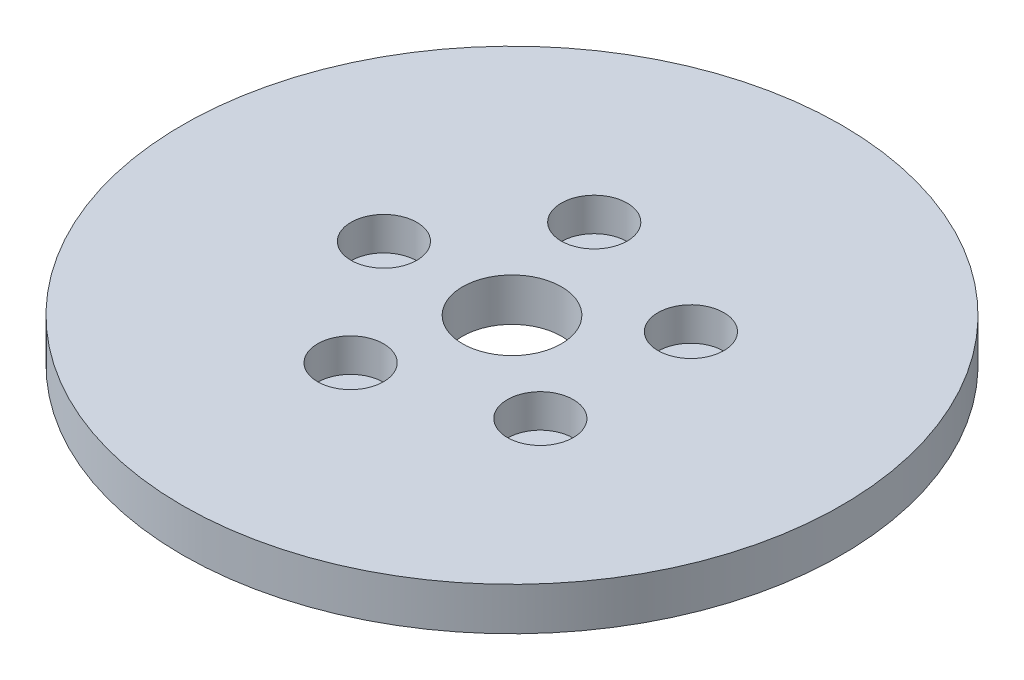
ISO-10303-21;
HEADER;
FILE_DESCRIPTION(('STEP AP214'),'2;1');
FILE_NAME('part.step','',(''),(''),'','','');
FILE_SCHEMA(('AUTOMOTIVE_DESIGN { 1 0 10303 214 1 1 1 1 }'));
ENDSEC;
DATA;
#1=APPLICATION_CONTEXT('core data for automotive mechanical design processes');
#2=APPLICATION_PROTOCOL_DEFINITION('international standard','automotive_design',2000,#1);
#3=PRODUCT_CONTEXT('',#1,'mechanical');
#4=PRODUCT('Part','Part','',(#3));
#5=PRODUCT_RELATED_PRODUCT_CATEGORY('part','',(#4));
#6=PRODUCT_DEFINITION_FORMATION('','',#4);
#7=PRODUCT_DEFINITION_CONTEXT('part definition',#1,'design');
#8=PRODUCT_DEFINITION('design','',#6,#7);
#9=PRODUCT_DEFINITION_SHAPE('','',#8);
#10=(LENGTH_UNIT() NAMED_UNIT(*) SI_UNIT(.MILLI.,.METRE.));
#11=(NAMED_UNIT(*) PLANE_ANGLE_UNIT() SI_UNIT($,.RADIAN.));
#12=(NAMED_UNIT(*) SI_UNIT($,.STERADIAN.) SOLID_ANGLE_UNIT());
#13=UNCERTAINTY_MEASURE_WITH_UNIT(LENGTH_MEASURE(1.E-05),#10,'distance_accuracy_value','');
#14=(GEOMETRIC_REPRESENTATION_CONTEXT(3) GLOBAL_UNCERTAINTY_ASSIGNED_CONTEXT((#13)) GLOBAL_UNIT_ASSIGNED_CONTEXT((#10,
#11,#12)) REPRESENTATION_CONTEXT('',''));
#15=CARTESIAN_POINT('',(0.,0.,0.));
#16=DIRECTION('',(0.,0.,1.));
#17=DIRECTION('',(1.,0.,0.));
#18=AXIS2_PLACEMENT_3D('',#15,#16,#17);
#19=CARTESIAN_POINT('',(0.,13.,0.));
#20=DIRECTION('',(0.,-1.,0.));
#21=DIRECTION('',(0.,0.,-1.));
#22=AXIS2_PLACEMENT_3D('',#19,#20,#21);
#23=CYLINDRICAL_SURFACE('',#22,100.);
#24=CARTESIAN_POINT('',(0.,13.,0.));
#25=DIRECTION('',(0.,1.,0.));
#26=DIRECTION('',(0.,0.,1.));
#27=AXIS2_PLACEMENT_3D('',#24,#25,#26);
#28=CIRCLE('',#27,100.);
#29=CARTESIAN_POINT('',(0.,13.,-100.));
#30=VERTEX_POINT('',#29);
#31=EDGE_CURVE('E10',#30,#30,#28,.T.);
#32=CARTESIAN_POINT('',(0.,0.,0.));
#33=DIRECTION('',(0.,1.,0.));
#34=DIRECTION('',(0.,0.,1.));
#35=AXIS2_PLACEMENT_3D('',#32,#33,#34);
#36=CIRCLE('',#35,100.);
#37=CARTESIAN_POINT('',(0.,0.,-100.));
#38=VERTEX_POINT('',#37);
#39=EDGE_CURVE('E37',#38,#38,#36,.T.);
#40=CARTESIAN_POINT('',(0.,13.,-100.));
#41=CARTESIAN_POINT('',(0.,12.8645833333333,-100.));
#42=CARTESIAN_POINT('',(0.,12.7291666666667,-100.));
#43=CARTESIAN_POINT('',(0.,12.4583333333333,-100.));
#44=CARTESIAN_POINT('',(0.,12.3229166666667,-100.));
#45=CARTESIAN_POINT('',(0.,12.0520833333333,-100.));
#46=CARTESIAN_POINT('',(0.,11.9166666666667,-100.));
#47=CARTESIAN_POINT('',(0.,11.6458333333333,-100.));
#48=CARTESIAN_POINT('',(0.,11.5104166666667,-100.));
#49=CARTESIAN_POINT('',(0.,11.2395833333333,-100.));
#50=CARTESIAN_POINT('',(0.,11.1041666666667,-100.));
#51=CARTESIAN_POINT('',(0.,10.8333333333333,-100.));
#52=CARTESIAN_POINT('',(0.,10.6979166666667,-100.));
#53=CARTESIAN_POINT('',(0.,10.4270833333333,-100.));
#54=CARTESIAN_POINT('',(0.,10.2916666666667,-100.));
#55=CARTESIAN_POINT('',(0.,10.0208333333333,-100.));
#56=CARTESIAN_POINT('',(0.,9.88541666666667,-100.));
#57=CARTESIAN_POINT('',(0.,9.61458333333333,-100.));
#58=CARTESIAN_POINT('',(0.,9.47916666666667,-100.));
#59=CARTESIAN_POINT('',(0.,9.20833333333333,-100.));
#60=CARTESIAN_POINT('',(0.,9.07291666666666,-100.));
#61=CARTESIAN_POINT('',(0.,8.80208333333333,-100.));
#62=CARTESIAN_POINT('',(0.,8.66666666666667,-100.));
#63=CARTESIAN_POINT('',(0.,8.39583333333333,-100.));
#64=CARTESIAN_POINT('',(0.,8.26041666666667,-100.));
#65=CARTESIAN_POINT('',(0.,7.98958333333333,-100.));
#66=CARTESIAN_POINT('',(0.,7.85416666666667,-100.));
#67=CARTESIAN_POINT('',(0.,7.58333333333333,-100.));
#68=CARTESIAN_POINT('',(0.,7.44791666666667,-100.));
#69=CARTESIAN_POINT('',(0.,7.17708333333333,-100.));
#70=CARTESIAN_POINT('',(0.,7.04166666666667,-100.));
#71=CARTESIAN_POINT('',(0.,6.77083333333333,-100.));
#72=CARTESIAN_POINT('',(0.,6.63541666666667,-100.));
#73=CARTESIAN_POINT('',(0.,6.36458333333333,-100.));
#74=CARTESIAN_POINT('',(0.,6.22916666666667,-100.));
#75=CARTESIAN_POINT('',(0.,5.95833333333333,-100.));
#76=CARTESIAN_POINT('',(0.,5.82291666666667,-100.));
#77=CARTESIAN_POINT('',(0.,5.55208333333333,-100.));
#78=CARTESIAN_POINT('',(0.,5.41666666666667,-100.));
#79=CARTESIAN_POINT('',(0.,5.14583333333333,-100.));
#80=CARTESIAN_POINT('',(0.,5.01041666666667,-100.));
#81=CARTESIAN_POINT('',(0.,4.73958333333333,-100.));
#82=CARTESIAN_POINT('',(0.,4.60416666666667,-100.));
#83=CARTESIAN_POINT('',(0.,4.33333333333333,-100.));
#84=CARTESIAN_POINT('',(0.,4.19791666666667,-100.));
#85=CARTESIAN_POINT('',(0.,3.92708333333333,-100.));
#86=CARTESIAN_POINT('',(0.,3.79166666666667,-100.));
#87=CARTESIAN_POINT('',(0.,3.52083333333333,-100.));
#88=CARTESIAN_POINT('',(0.,3.38541666666667,-100.));
#89=CARTESIAN_POINT('',(0.,3.11458333333333,-100.));
#90=CARTESIAN_POINT('',(0.,2.97916666666667,-100.));
#91=CARTESIAN_POINT('',(0.,2.70833333333333,-100.));
#92=CARTESIAN_POINT('',(0.,2.57291666666667,-100.));
#93=CARTESIAN_POINT('',(0.,2.30208333333333,-100.));
#94=CARTESIAN_POINT('',(0.,2.16666666666667,-100.));
#95=CARTESIAN_POINT('',(0.,1.89583333333333,-100.));
#96=CARTESIAN_POINT('',(0.,1.76041666666667,-100.));
#97=CARTESIAN_POINT('',(0.,1.48958333333333,-100.));
#98=CARTESIAN_POINT('',(0.,1.35416666666667,-100.));
#99=CARTESIAN_POINT('',(0.,1.08333333333333,-100.));
#100=CARTESIAN_POINT('',(0.,0.947916666666667,-100.));
#101=CARTESIAN_POINT('',(0.,0.677083333333334,-100.));
#102=CARTESIAN_POINT('',(0.,0.541666666666667,-100.));
#103=CARTESIAN_POINT('',(0.,0.270833333333334,-100.));
#104=CARTESIAN_POINT('',(0.,0.135416666666667,-100.));
#105=CARTESIAN_POINT('',(0.,0.,-100.));
#106=B_SPLINE_CURVE_WITH_KNOTS('',3,(#40,#41,#42,#43,#44,#45,#46,#47,#48,#49,#50,#51,#52,#53,
#54,#55,#56,#57,#58,#59,#60,#61,#62,#63,#64,#65,#66,#67,#68,#69,#70,#71,#72,#73,#74,#75,#76,#77,
#78,#79,#80,#81,#82,#83,#84,#85,#86,#87,#88,#89,#90,#91,#92,#93,#94,#95,#96,#97,#98,#99,#100,
#101,#102,#103,#104,#105),.UNSPECIFIED.,.F.,.F.,(4,2,2,2,2,2,2,2,2,2,2,2,2,2,2,2,2,2,2,2,2,2,2,
2,2,2,2,2,2,2,2,2,4),(0.,0.40625,0.812500000000001,1.21875,1.625,2.03125,2.4375,2.84375,3.25,
3.65625,4.0625,4.46875,4.875,5.28125,5.6875,6.09375,6.5,6.90625,7.3125,7.71875,8.125,8.53125,
8.9375,9.34375,9.75,10.15625,10.5625,10.96875,11.375,11.78125,12.1875,12.59375,13.),.UNSPECIFIED.);
#107=EDGE_CURVE('BSEAM40',#30,#38,#106,.T.);
#108=ORIENTED_EDGE('',*,*,#31,.F.);
#109=ORIENTED_EDGE('',*,*,#39,.T.);
#110=ORIENTED_EDGE('',*,*,#107,.T.);
#111=ORIENTED_EDGE('',*,*,#107,.F.);
#112=EDGE_LOOP('',(#108,#110,#109,#111));
#113=FACE_BOUND('',#112,.T.);
#114=ADVANCED_FACE('F40',(#113),#23,.T.);
#115=CARTESIAN_POINT('',(0.,13.,0.));
#116=DIRECTION('',(0.,1.,0.));
#117=DIRECTION('',(0.,0.,1.));
#118=AXIS2_PLACEMENT_3D('',#115,#116,#117);
#119=PLANE('',#118);
#120=CARTESIAN_POINT('',(-12.0110621570786,13.,-36.9662482648281));
#121=DIRECTION('',(0.,1.,0.));
#122=DIRECTION('',(-0.95105651629515,0.,0.309016994374958));
#123=AXIS2_PLACEMENT_3D('',#120,#121,#122);
#124=CIRCLE('',#123,10.);
#125=CARTESIAN_POINT('',(-21.5216273200301,13.,-33.8760783210785));
#126=VERTEX_POINT('',#125);
#127=EDGE_CURVE('E70',#126,#126,#124,.T.);
#128=ORIENTED_EDGE('',*,*,#127,.F.);
#129=EDGE_LOOP('',(#128));
#130=FACE_BOUND('',#129,.T.);
#131=CARTESIAN_POINT('',(31.4453689682181,13.,-22.846397864231));
#132=DIRECTION('',(0.,1.,0.));
#133=DIRECTION('',(-0.58778525229248,0.,-0.809016994374942));
#134=AXIS2_PLACEMENT_3D('',#131,#132,#133);
#135=CIRCLE('',#134,10.);
#136=CARTESIAN_POINT('',(25.5675164452933,13.,-30.9365678079804));
#137=VERTEX_POINT('',#136);
#138=EDGE_CURVE('E71',#137,#137,#135,.T.);
#139=ORIENTED_EDGE('',*,*,#138,.F.);
#140=EDGE_LOOP('',(#139));
#141=FACE_BOUND('',#140,.T.);
#142=CARTESIAN_POINT('',(31.4453689682185,13.,22.8463978642305));
#143=DIRECTION('',(0.,1.,0.));
#144=DIRECTION('',(0.587785252292469,0.,-0.809016994374951));
#145=AXIS2_PLACEMENT_3D('',#142,#143,#144);
#146=CIRCLE('',#145,10.);
#147=CARTESIAN_POINT('',(37.3232214911432,13.,14.756227920481));
#148=VERTEX_POINT('',#147);
#149=EDGE_CURVE('E78',#148,#148,#146,.T.);
#150=ORIENTED_EDGE('',*,*,#149,.F.);
#151=EDGE_LOOP('',(#150));
#152=FACE_BOUND('',#151,.T.);
#153=CARTESIAN_POINT('',(-12.0110621570781,13.,36.9662482648283));
#154=DIRECTION('',(0.,1.,0.));
#155=DIRECTION('',(0.951056516295155,0.,0.309016994374945));
#156=AXIS2_PLACEMENT_3D('',#153,#154,#155);
#157=CIRCLE('',#156,10.);
#158=CARTESIAN_POINT('',(-2.50049699412654,13.,40.0564182085777));
#159=VERTEX_POINT('',#158);
#160=EDGE_CURVE('E61',#159,#159,#157,.T.);
#161=ORIENTED_EDGE('',*,*,#160,.F.);
#162=EDGE_LOOP('',(#161));
#163=FACE_BOUND('',#162,.T.);
#164=CARTESIAN_POINT('',(-38.8686136222803,13.,0.));
#165=DIRECTION('',(0.,1.,0.));
#166=DIRECTION('',(0.,0.,1.));
#167=AXIS2_PLACEMENT_3D('',#164,#165,#166);
#168=CIRCLE('',#167,10.);
#169=CARTESIAN_POINT('',(-38.8686136222803,13.,10.));
#170=VERTEX_POINT('',#169);
#171=EDGE_CURVE('E54',#170,#170,#168,.T.);
#172=ORIENTED_EDGE('',*,*,#171,.F.);
#173=EDGE_LOOP('',(#172));
#174=FACE_BOUND('',#173,.T.);
#175=CARTESIAN_POINT('',(0.,13.,0.));
#176=DIRECTION('',(0.,1.,0.));
#177=DIRECTION('',(0.,0.,1.));
#178=AXIS2_PLACEMENT_3D('',#175,#176,#177);
#179=CIRCLE('',#178,15.);
#180=CARTESIAN_POINT('',(0.,13.,-15.));
#181=VERTEX_POINT('',#180);
#182=EDGE_CURVE('E50',#181,#181,#179,.T.);
#183=ORIENTED_EDGE('',*,*,#182,.F.);
#184=EDGE_LOOP('',(#183));
#185=FACE_BOUND('',#184,.T.);
#186=ORIENTED_EDGE('',*,*,#31,.T.);
#187=EDGE_LOOP('',(#186));
#188=FACE_BOUND('',#187,.T.);
#189=ADVANCED_FACE('F94',(#130,#141,#152,#163,#174,#185,#188),#119,.T.);
#190=CARTESIAN_POINT('',(0.,0.,0.));
#191=DIRECTION('',(0.,1.,0.));
#192=DIRECTION('',(0.,0.,1.));
#193=AXIS2_PLACEMENT_3D('',#190,#191,#192);
#194=PLANE('',#193);
#195=CARTESIAN_POINT('',(0.,0.,0.));
#196=DIRECTION('',(0.,1.,0.));
#197=DIRECTION('',(0.,0.,1.));
#198=AXIS2_PLACEMENT_3D('',#195,#196,#197);
#199=CIRCLE('',#198,15.);
#200=CARTESIAN_POINT('',(0.,0.,-15.));
#201=VERTEX_POINT('',#200);
#202=EDGE_CURVE('E47',#201,#201,#199,.T.);
#203=ORIENTED_EDGE('',*,*,#202,.T.);
#204=EDGE_LOOP('',(#203));
#205=FACE_BOUND('',#204,.T.);
#206=ORIENTED_EDGE('',*,*,#39,.F.);
#207=EDGE_LOOP('',(#206));
#208=FACE_BOUND('',#207,.T.);
#209=ADVANCED_FACE('F100',(#205,#208),#194,.F.);
#210=CARTESIAN_POINT('',(0.,13.,0.));
#211=DIRECTION('',(0.,-1.,0.));
#212=DIRECTION('',(0.,0.,-1.));
#213=AXIS2_PLACEMENT_3D('',#210,#211,#212);
#214=CYLINDRICAL_SURFACE('',#213,15.);
#215=CARTESIAN_POINT('',(0.,13.,-15.));
#216=CARTESIAN_POINT('',(0.,12.8645833333333,-15.));
#217=CARTESIAN_POINT('',(0.,12.7291666666667,-15.));
#218=CARTESIAN_POINT('',(0.,12.4583333333333,-15.));
#219=CARTESIAN_POINT('',(0.,12.3229166666667,-15.));
#220=CARTESIAN_POINT('',(0.,12.0520833333333,-15.));
#221=CARTESIAN_POINT('',(0.,11.9166666666667,-15.));
#222=CARTESIAN_POINT('',(0.,11.6458333333333,-15.));
#223=CARTESIAN_POINT('',(0.,11.5104166666667,-15.));
#224=CARTESIAN_POINT('',(0.,11.2395833333333,-15.));
#225=CARTESIAN_POINT('',(0.,11.1041666666667,-15.));
#226=CARTESIAN_POINT('',(0.,10.8333333333333,-15.));
#227=CARTESIAN_POINT('',(0.,10.6979166666667,-15.));
#228=CARTESIAN_POINT('',(0.,10.4270833333333,-15.));
#229=CARTESIAN_POINT('',(0.,10.2916666666667,-15.));
#230=CARTESIAN_POINT('',(0.,10.0208333333333,-15.));
#231=CARTESIAN_POINT('',(0.,9.88541666666667,-15.));
#232=CARTESIAN_POINT('',(0.,9.61458333333333,-15.));
#233=CARTESIAN_POINT('',(0.,9.47916666666667,-15.));
#234=CARTESIAN_POINT('',(0.,9.20833333333333,-15.));
#235=CARTESIAN_POINT('',(0.,9.07291666666666,-15.));
#236=CARTESIAN_POINT('',(0.,8.80208333333333,-15.));
#237=CARTESIAN_POINT('',(0.,8.66666666666667,-15.));
#238=CARTESIAN_POINT('',(0.,8.39583333333333,-15.));
#239=CARTESIAN_POINT('',(0.,8.26041666666667,-15.));
#240=CARTESIAN_POINT('',(0.,7.98958333333333,-15.));
#241=CARTESIAN_POINT('',(0.,7.85416666666667,-15.));
#242=CARTESIAN_POINT('',(0.,7.58333333333333,-15.));
#243=CARTESIAN_POINT('',(0.,7.44791666666667,-15.));
#244=CARTESIAN_POINT('',(0.,7.17708333333333,-15.));
#245=CARTESIAN_POINT('',(0.,7.04166666666667,-15.));
#246=CARTESIAN_POINT('',(0.,6.77083333333333,-15.));
#247=CARTESIAN_POINT('',(0.,6.63541666666667,-15.));
#248=CARTESIAN_POINT('',(0.,6.36458333333333,-15.));
#249=CARTESIAN_POINT('',(0.,6.22916666666667,-15.));
#250=CARTESIAN_POINT('',(0.,5.95833333333333,-15.));
#251=CARTESIAN_POINT('',(0.,5.82291666666667,-15.));
#252=CARTESIAN_POINT('',(0.,5.55208333333333,-15.));
#253=CARTESIAN_POINT('',(0.,5.41666666666667,-15.));
#254=CARTESIAN_POINT('',(0.,5.14583333333333,-15.));
#255=CARTESIAN_POINT('',(0.,5.01041666666667,-15.));
#256=CARTESIAN_POINT('',(0.,4.73958333333333,-15.));
#257=CARTESIAN_POINT('',(0.,4.60416666666667,-15.));
#258=CARTESIAN_POINT('',(0.,4.33333333333333,-15.));
#259=CARTESIAN_POINT('',(0.,4.19791666666667,-15.));
#260=CARTESIAN_POINT('',(0.,3.92708333333333,-15.));
#261=CARTESIAN_POINT('',(0.,3.79166666666667,-15.));
#262=CARTESIAN_POINT('',(0.,3.52083333333333,-15.));
#263=CARTESIAN_POINT('',(0.,3.38541666666667,-15.));
#264=CARTESIAN_POINT('',(0.,3.11458333333333,-15.));
#265=CARTESIAN_POINT('',(0.,2.97916666666667,-15.));
#266=CARTESIAN_POINT('',(0.,2.70833333333333,-15.));
#267=CARTESIAN_POINT('',(0.,2.57291666666667,-15.));
#268=CARTESIAN_POINT('',(0.,2.30208333333333,-15.));
#269=CARTESIAN_POINT('',(0.,2.16666666666667,-15.));
#270=CARTESIAN_POINT('',(0.,1.89583333333333,-15.));
#271=CARTESIAN_POINT('',(0.,1.76041666666667,-15.));
#272=CARTESIAN_POINT('',(0.,1.48958333333333,-15.));
#273=CARTESIAN_POINT('',(0.,1.35416666666667,-15.));
#274=CARTESIAN_POINT('',(0.,1.08333333333333,-15.));
#275=CARTESIAN_POINT('',(0.,0.947916666666667,-15.));
#276=CARTESIAN_POINT('',(0.,0.677083333333334,-15.));
#277=CARTESIAN_POINT('',(0.,0.541666666666667,-15.));
#278=CARTESIAN_POINT('',(0.,0.270833333333334,-15.));
#279=CARTESIAN_POINT('',(0.,0.135416666666667,-15.));
#280=CARTESIAN_POINT('',(0.,0.,-15.));
#281=B_SPLINE_CURVE_WITH_KNOTS('',3,(#215,#216,#217,#218,#219,#220,#221,#222,#223,#224,#225,
#226,#227,#228,#229,#230,#231,#232,#233,#234,#235,#236,#237,#238,#239,#240,#241,#242,#243,#244,
#245,#246,#247,#248,#249,#250,#251,#252,#253,#254,#255,#256,#257,#258,#259,#260,#261,#262,#263,
#264,#265,#266,#267,#268,#269,#270,#271,#272,#273,#274,#275,#276,#277,#278,#279,#280),
.UNSPECIFIED.,.F.,.F.,(4,2,2,2,2,2,2,2,2,2,2,2,2,2,2,2,2,2,2,2,2,2,2,2,2,2,2,2,2,2,2,2,4),(0.,
0.40625,0.812500000000001,1.21875,1.625,2.03125,2.4375,2.84375,3.25,3.65625,4.0625,4.46875,
4.875,5.28125,5.6875,6.09375,6.5,6.90625,7.3125,7.71875,8.125,8.53125,8.9375,9.34375,9.75,
10.15625,10.5625,10.96875,11.375,11.78125,12.1875,12.59375,13.),.UNSPECIFIED.);
#282=EDGE_CURVE('BSEAM106',#181,#201,#281,.T.);
#283=ORIENTED_EDGE('',*,*,#182,.T.);
#284=ORIENTED_EDGE('',*,*,#202,.F.);
#285=ORIENTED_EDGE('',*,*,#282,.T.);
#286=ORIENTED_EDGE('',*,*,#282,.F.);
#287=EDGE_LOOP('',(#283,#285,#284,#286));
#288=FACE_BOUND('',#287,.T.);
#289=ADVANCED_FACE('F106',(#288),#214,.F.);
#290=CARTESIAN_POINT('',(-38.8686136222803,2.87692025891722,0.));
#291=DIRECTION('',(0.,1.,0.));
#292=DIRECTION('',(0.,0.,1.));
#293=AXIS2_PLACEMENT_3D('',#290,#291,#292);
#294=CYLINDRICAL_SURFACE('',#293,10.);
#295=CARTESIAN_POINT('',(-38.8686136222803,2.87692025891722,0.));
#296=DIRECTION('',(0.,1.,0.));
#297=DIRECTION('',(0.,0.,1.));
#298=AXIS2_PLACEMENT_3D('',#295,#296,#297);
#299=CIRCLE('',#298,10.);
#300=CARTESIAN_POINT('',(-38.8686136222803,2.87692025891722,10.));
#301=VERTEX_POINT('',#300);
#302=EDGE_CURVE('E55',#301,#301,#299,.T.);
#303=ORIENTED_EDGE('',*,*,#302,.F.);
#304=EDGE_LOOP('',(#303));
#305=FACE_BOUND('',#304,.T.);
#306=ORIENTED_EDGE('',*,*,#171,.T.);
#307=EDGE_LOOP('',(#306));
#308=FACE_BOUND('',#307,.T.);
#309=ADVANCED_FACE('F108',(#305,#308),#294,.F.);
#310=CARTESIAN_POINT('',(-38.8686136222803,2.87692025891722,0.));
#311=DIRECTION('',(0.,1.,0.));
#312=DIRECTION('',(0.,0.,1.));
#313=AXIS2_PLACEMENT_3D('',#310,#311,#312);
#314=PLANE('',#313);
#315=ORIENTED_EDGE('',*,*,#302,.T.);
#316=EDGE_LOOP('',(#315));
#317=FACE_BOUND('',#316,.T.);
#318=ADVANCED_FACE('F138',(#317),#314,.T.);
#319=CARTESIAN_POINT('',(-12.0110621570781,2.87692025891722,36.9662482648283));
#320=DIRECTION('',(0.,1.,0.));
#321=DIRECTION('',(0.,0.,1.));
#322=AXIS2_PLACEMENT_3D('',#319,#320,#321);
#323=CYLINDRICAL_SURFACE('',#322,10.);
#324=CARTESIAN_POINT('',(-12.0110621570781,2.87692025891722,36.9662482648283));
#325=DIRECTION('',(0.,1.,0.));
#326=DIRECTION('',(0.951056516295155,0.,0.309016994374945));
#327=AXIS2_PLACEMENT_3D('',#324,#325,#326);
#328=CIRCLE('',#327,10.);
#329=CARTESIAN_POINT('',(-2.50049699412654,2.87692025891722,40.0564182085777));
#330=VERTEX_POINT('',#329);
#331=EDGE_CURVE('E59',#330,#330,#328,.T.);
#332=ORIENTED_EDGE('',*,*,#331,.F.);
#333=EDGE_LOOP('',(#332));
#334=FACE_BOUND('',#333,.T.);
#335=ORIENTED_EDGE('',*,*,#160,.T.);
#336=EDGE_LOOP('',(#335));
#337=FACE_BOUND('',#336,.T.);
#338=ADVANCED_FACE('F150',(#334,#337),#323,.F.);
#339=CARTESIAN_POINT('',(-12.0110621570781,2.87692025891722,36.9662482648283));
#340=DIRECTION('',(0.,1.,0.));
#341=DIRECTION('',(0.951056516295155,0.,0.309016994374945));
#342=AXIS2_PLACEMENT_3D('',#339,#340,#341);
#343=PLANE('',#342);
#344=ORIENTED_EDGE('',*,*,#331,.T.);
#345=EDGE_LOOP('',(#344));
#346=FACE_BOUND('',#345,.T.);
#347=ADVANCED_FACE('F89',(#346),#343,.T.);
#348=CARTESIAN_POINT('',(31.4453689682185,2.87692025891722,22.8463978642305));
#349=DIRECTION('',(0.,1.,0.));
#350=DIRECTION('',(0.,0.,1.));
#351=AXIS2_PLACEMENT_3D('',#348,#349,#350);
#352=CYLINDRICAL_SURFACE('',#351,10.);
#353=CARTESIAN_POINT('',(31.4453689682185,2.87692025891722,22.8463978642305));
#354=DIRECTION('',(0.,1.,0.));
#355=DIRECTION('',(0.587785252292469,0.,-0.809016994374951));
#356=AXIS2_PLACEMENT_3D('',#353,#354,#355);
#357=CIRCLE('',#356,10.);
#358=CARTESIAN_POINT('',(37.3232214911432,2.87692025891722,14.756227920481));
#359=VERTEX_POINT('',#358);
#360=EDGE_CURVE('E63',#359,#359,#357,.T.);
#361=ORIENTED_EDGE('',*,*,#360,.F.);
#362=EDGE_LOOP('',(#361));
#363=FACE_BOUND('',#362,.T.);
#364=ORIENTED_EDGE('',*,*,#149,.T.);
#365=EDGE_LOOP('',(#364));
#366=FACE_BOUND('',#365,.T.);
#367=ADVANCED_FACE('F87',(#363,#366),#352,.F.);
#368=CARTESIAN_POINT('',(31.4453689682185,2.87692025891722,22.8463978642305));
#369=DIRECTION('',(0.,1.,0.));
#370=DIRECTION('',(0.587785252292469,0.,-0.809016994374951));
#371=AXIS2_PLACEMENT_3D('',#368,#369,#370);
#372=PLANE('',#371);
#373=ORIENTED_EDGE('',*,*,#360,.T.);
#374=EDGE_LOOP('',(#373));
#375=FACE_BOUND('',#374,.T.);
#376=ADVANCED_FACE('F84',(#375),#372,.T.);
#377=CARTESIAN_POINT('',(31.4453689682181,2.87692025891722,-22.846397864231));
#378=DIRECTION('',(0.,1.,0.));
#379=DIRECTION('',(0.,0.,1.));
#380=AXIS2_PLACEMENT_3D('',#377,#378,#379);
#381=CYLINDRICAL_SURFACE('',#380,10.);
#382=CARTESIAN_POINT('',(31.4453689682181,2.87692025891722,-22.846397864231));
#383=DIRECTION('',(0.,1.,0.));
#384=DIRECTION('',(-0.58778525229248,0.,-0.809016994374942));
#385=AXIS2_PLACEMENT_3D('',#382,#383,#384);
#386=CIRCLE('',#385,10.);
#387=CARTESIAN_POINT('',(25.5675164452933,2.87692025891722,-30.9365678079804));
#388=VERTEX_POINT('',#387);
#389=EDGE_CURVE('E76',#388,#388,#386,.T.);
#390=ORIENTED_EDGE('',*,*,#389,.F.);
#391=EDGE_LOOP('',(#390));
#392=FACE_BOUND('',#391,.T.);
#393=ORIENTED_EDGE('',*,*,#138,.T.);
#394=EDGE_LOOP('',(#393));
#395=FACE_BOUND('',#394,.T.);
#396=ADVANCED_FACE('F185',(#392,#395),#381,.F.);
#397=CARTESIAN_POINT('',(31.4453689682181,2.87692025891722,-22.846397864231));
#398=DIRECTION('',(0.,1.,0.));
#399=DIRECTION('',(-0.58778525229248,0.,-0.809016994374942));
#400=AXIS2_PLACEMENT_3D('',#397,#398,#399);
#401=PLANE('',#400);
#402=ORIENTED_EDGE('',*,*,#389,.T.);
#403=EDGE_LOOP('',(#402));
#404=FACE_BOUND('',#403,.T.);
#405=ADVANCED_FACE('F189',(#404),#401,.T.);
#406=CARTESIAN_POINT('',(-12.0110621570786,2.87692025891722,-36.9662482648281));
#407=DIRECTION('',(0.,1.,0.));
#408=DIRECTION('',(0.,0.,1.));
#409=AXIS2_PLACEMENT_3D('',#406,#407,#408);
#410=CYLINDRICAL_SURFACE('',#409,10.);
#411=CARTESIAN_POINT('',(-12.0110621570786,2.87692025891722,-36.9662482648281));
#412=DIRECTION('',(0.,1.,0.));
#413=DIRECTION('',(-0.95105651629515,0.,0.309016994374958));
#414=AXIS2_PLACEMENT_3D('',#411,#412,#413);
#415=CIRCLE('',#414,10.);
#416=CARTESIAN_POINT('',(-21.5216273200301,2.87692025891722,-33.8760783210785));
#417=VERTEX_POINT('',#416);
#418=EDGE_CURVE('E69',#417,#417,#415,.T.);
#419=ORIENTED_EDGE('',*,*,#418,.F.);
#420=EDGE_LOOP('',(#419));
#421=FACE_BOUND('',#420,.T.);
#422=ORIENTED_EDGE('',*,*,#127,.T.);
#423=EDGE_LOOP('',(#422));
#424=FACE_BOUND('',#423,.T.);
#425=ADVANCED_FACE('F200',(#421,#424),#410,.F.);
#426=CARTESIAN_POINT('',(-12.0110621570786,2.87692025891722,-36.9662482648281));
#427=DIRECTION('',(0.,1.,0.));
#428=DIRECTION('',(-0.95105651629515,0.,0.309016994374958));
#429=AXIS2_PLACEMENT_3D('',#426,#427,#428);
#430=PLANE('',#429);
#431=ORIENTED_EDGE('',*,*,#418,.T.);
#432=EDGE_LOOP('',(#431));
#433=FACE_BOUND('',#432,.T.);
#434=ADVANCED_FACE('F208',(#433),#430,.T.);
#435=CLOSED_SHELL('',(#114,#189,#209,#289,#309,#318,#338,#347,#367,#376,#396,#405,#425,#434));
#436=MANIFOLD_SOLID_BREP('B2',#435);
#437=ADVANCED_BREP_SHAPE_REPRESENTATION('',(#18,#436),#14);
#438=SHAPE_DEFINITION_REPRESENTATION(#9,#437);
ENDSEC;
END-ISO-10303-21;
